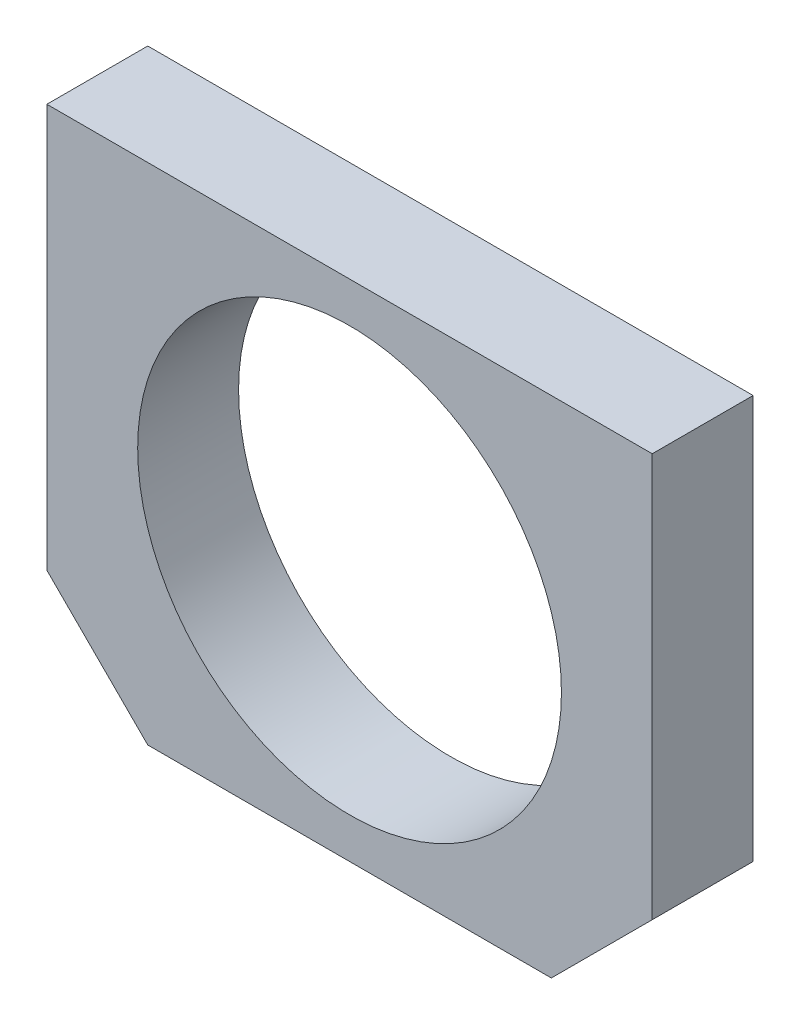
ISO-10303-21;
HEADER;
FILE_DESCRIPTION(('STEP AP214'),'2;1');
FILE_NAME('part.step','',(''),(''),'','','');
FILE_SCHEMA(('AUTOMOTIVE_DESIGN { 1 0 10303 214 1 1 1 1 }'));
ENDSEC;
DATA;
#1=APPLICATION_CONTEXT('core data for automotive mechanical design processes');
#2=APPLICATION_PROTOCOL_DEFINITION('international standard','automotive_design',2000,#1);
#3=PRODUCT_CONTEXT('',#1,'mechanical');
#4=PRODUCT('Part','Part','',(#3));
#5=PRODUCT_RELATED_PRODUCT_CATEGORY('part','',(#4));
#6=PRODUCT_DEFINITION_FORMATION('','',#4);
#7=PRODUCT_DEFINITION_CONTEXT('part definition',#1,'design');
#8=PRODUCT_DEFINITION('design','',#6,#7);
#9=PRODUCT_DEFINITION_SHAPE('','',#8);
#10=(LENGTH_UNIT() NAMED_UNIT(*) SI_UNIT(.MILLI.,.METRE.));
#11=(NAMED_UNIT(*) PLANE_ANGLE_UNIT() SI_UNIT($,.RADIAN.));
#12=(NAMED_UNIT(*) SI_UNIT($,.STERADIAN.) SOLID_ANGLE_UNIT());
#13=UNCERTAINTY_MEASURE_WITH_UNIT(LENGTH_MEASURE(1.E-05),#10,'distance_accuracy_value','');
#14=(GEOMETRIC_REPRESENTATION_CONTEXT(3) GLOBAL_UNCERTAINTY_ASSIGNED_CONTEXT((#13)) GLOBAL_UNIT_ASSIGNED_CONTEXT((#10,
#11,#12)) REPRESENTATION_CONTEXT('',''));
#15=CARTESIAN_POINT('',(0.,0.,0.));
#16=DIRECTION('',(0.,0.,1.));
#17=DIRECTION('',(1.,0.,0.));
#18=AXIS2_PLACEMENT_3D('',#15,#16,#17);
#19=CARTESIAN_POINT('',(0.,0.,10.));
#20=DIRECTION('',(0.,0.,1.));
#21=DIRECTION('',(1.,0.,0.));
#22=AXIS2_PLACEMENT_3D('',#19,#20,#21);
#23=PLANE('',#22);
#24=DIRECTION('',(-1.,0.,0.));
#25=VECTOR('',#24,1.);
#26=CARTESIAN_POINT('',(30.,25.,10.));
#27=LINE('',#26,#25);
#28=CARTESIAN_POINT('',(30.,25.,10.));
#29=VERTEX_POINT('',#28);
#30=CARTESIAN_POINT('',(-30.,25.,10.));
#31=VERTEX_POINT('',#30);
#32=EDGE_CURVE('E128',#29,#31,#27,.T.);
#33=ORIENTED_EDGE('',*,*,#32,.T.);
#34=DIRECTION('',(0.,-1.,0.));
#35=VECTOR('',#34,1.);
#36=CARTESIAN_POINT('',(-30.,25.,10.));
#37=LINE('',#36,#35);
#38=CARTESIAN_POINT('',(-30.,-15.,10.));
#39=VERTEX_POINT('',#38);
#40=EDGE_CURVE('E86',#31,#39,#37,.T.);
#41=ORIENTED_EDGE('',*,*,#40,.T.);
#42=DIRECTION('',(0.707106781186549,-0.707106781186546,0.));
#43=VECTOR('',#42,1.);
#44=CARTESIAN_POINT('',(-30.,-15.,10.));
#45=LINE('',#44,#43);
#46=CARTESIAN_POINT('',(-20.,-25.,10.));
#47=VERTEX_POINT('',#46);
#48=EDGE_CURVE('E99',#39,#47,#45,.T.);
#49=ORIENTED_EDGE('',*,*,#48,.T.);
#50=DIRECTION('',(1.,0.,0.));
#51=VECTOR('',#50,1.);
#52=CARTESIAN_POINT('',(-20.,-25.,10.));
#53=LINE('',#52,#51);
#54=CARTESIAN_POINT('',(20.,-25.,10.));
#55=VERTEX_POINT('',#54);
#56=EDGE_CURVE('E93',#47,#55,#53,.T.);
#57=ORIENTED_EDGE('',*,*,#56,.T.);
#58=DIRECTION('',(0.707106781186549,0.707106781186546,0.));
#59=VECTOR('',#58,1.);
#60=CARTESIAN_POINT('',(20.,-25.,10.));
#61=LINE('',#60,#59);
#62=CARTESIAN_POINT('',(30.,-15.,10.));
#63=VERTEX_POINT('',#62);
#64=EDGE_CURVE('E97',#55,#63,#61,.T.);
#65=ORIENTED_EDGE('',*,*,#64,.T.);
#66=DIRECTION('',(0.,1.,0.));
#67=VECTOR('',#66,1.);
#68=CARTESIAN_POINT('',(30.,-15.,10.));
#69=LINE('',#68,#67);
#70=EDGE_CURVE('E49',#63,#29,#69,.T.);
#71=ORIENTED_EDGE('',*,*,#70,.T.);
#72=EDGE_LOOP('',(#33,#41,#49,#57,#65,#71));
#73=FACE_BOUND('',#72,.T.);
#74=CARTESIAN_POINT('',(0.,0.,10.));
#75=DIRECTION('',(0.,0.,1.));
#76=DIRECTION('',(1.,0.,0.));
#77=AXIS2_PLACEMENT_3D('',#74,#75,#76);
#78=CIRCLE('',#77,21.);
#79=CARTESIAN_POINT('',(21.,0.,10.));
#80=VERTEX_POINT('',#79);
#81=EDGE_CURVE('E121',#80,#80,#78,.T.);
#82=ORIENTED_EDGE('',*,*,#81,.F.);
#83=EDGE_LOOP('',(#82));
#84=FACE_BOUND('',#83,.T.);
#85=ADVANCED_FACE('F32',(#73,#84),#23,.T.);
#86=CARTESIAN_POINT('',(0.,0.,0.));
#87=DIRECTION('',(0.,0.,1.));
#88=DIRECTION('',(1.,0.,0.));
#89=AXIS2_PLACEMENT_3D('',#86,#87,#88);
#90=PLANE('',#89);
#91=DIRECTION('',(-1.,0.,0.));
#92=VECTOR('',#91,1.);
#93=CARTESIAN_POINT('',(30.,25.,0.));
#94=LINE('',#93,#92);
#95=CARTESIAN_POINT('',(30.,25.,0.));
#96=VERTEX_POINT('',#95);
#97=CARTESIAN_POINT('',(-30.,25.,0.));
#98=VERTEX_POINT('',#97);
#99=EDGE_CURVE('E117',#96,#98,#94,.T.);
#100=ORIENTED_EDGE('',*,*,#99,.F.);
#101=DIRECTION('',(0.,1.,0.));
#102=VECTOR('',#101,1.);
#103=CARTESIAN_POINT('',(30.,-15.,0.));
#104=LINE('',#103,#102);
#105=CARTESIAN_POINT('',(30.,-15.,0.));
#106=VERTEX_POINT('',#105);
#107=EDGE_CURVE('E78',#106,#96,#104,.T.);
#108=ORIENTED_EDGE('',*,*,#107,.F.);
#109=DIRECTION('',(0.707106781186549,0.707106781186546,0.));
#110=VECTOR('',#109,1.);
#111=CARTESIAN_POINT('',(20.,-25.,0.));
#112=LINE('',#111,#110);
#113=CARTESIAN_POINT('',(20.,-25.,0.));
#114=VERTEX_POINT('',#113);
#115=EDGE_CURVE('E72',#114,#106,#112,.T.);
#116=ORIENTED_EDGE('',*,*,#115,.F.);
#117=DIRECTION('',(1.,0.,0.));
#118=VECTOR('',#117,1.);
#119=CARTESIAN_POINT('',(-20.,-25.,0.));
#120=LINE('',#119,#118);
#121=CARTESIAN_POINT('',(-20.,-25.,0.));
#122=VERTEX_POINT('',#121);
#123=EDGE_CURVE('E107',#122,#114,#120,.T.);
#124=ORIENTED_EDGE('',*,*,#123,.F.);
#125=DIRECTION('',(0.707106781186549,-0.707106781186546,0.));
#126=VECTOR('',#125,1.);
#127=CARTESIAN_POINT('',(-30.,-15.,0.));
#128=LINE('',#127,#126);
#129=CARTESIAN_POINT('',(-30.,-15.,0.));
#130=VERTEX_POINT('',#129);
#131=EDGE_CURVE('E123',#130,#122,#128,.T.);
#132=ORIENTED_EDGE('',*,*,#131,.F.);
#133=DIRECTION('',(0.,-1.,0.));
#134=VECTOR('',#133,1.);
#135=CARTESIAN_POINT('',(-30.,25.,0.));
#136=LINE('',#135,#134);
#137=EDGE_CURVE('E120',#98,#130,#136,.T.);
#138=ORIENTED_EDGE('',*,*,#137,.F.);
#139=EDGE_LOOP('',(#100,#108,#116,#124,#132,#138));
#140=FACE_BOUND('',#139,.T.);
#141=CARTESIAN_POINT('',(0.,0.,0.));
#142=DIRECTION('',(0.,0.,1.));
#143=DIRECTION('',(1.,0.,0.));
#144=AXIS2_PLACEMENT_3D('',#141,#142,#143);
#145=CIRCLE('',#144,21.);
#146=CARTESIAN_POINT('',(21.,0.,0.));
#147=VERTEX_POINT('',#146);
#148=EDGE_CURVE('E221',#147,#147,#145,.T.);
#149=ORIENTED_EDGE('',*,*,#148,.T.);
#150=EDGE_LOOP('',(#149));
#151=FACE_BOUND('',#150,.T.);
#152=ADVANCED_FACE('F137',(#140,#151),#90,.F.);
#153=CARTESIAN_POINT('',(30.,25.,10.));
#154=DIRECTION('',(0.,-1.,0.));
#155=DIRECTION('',(1.,0.,0.));
#156=AXIS2_PLACEMENT_3D('',#153,#154,#155);
#157=PLANE('',#156);
#158=ORIENTED_EDGE('',*,*,#99,.T.);
#159=DIRECTION('',(0.,0.,-1.));
#160=VECTOR('',#159,1.);
#161=CARTESIAN_POINT('',(-30.,25.,10.));
#162=LINE('',#161,#160);
#163=EDGE_CURVE('E11',#31,#98,#162,.T.);
#164=ORIENTED_EDGE('',*,*,#163,.F.);
#165=ORIENTED_EDGE('',*,*,#32,.F.);
#166=DIRECTION('',(0.,0.,-1.));
#167=VECTOR('',#166,1.);
#168=CARTESIAN_POINT('',(30.,25.,10.));
#169=LINE('',#168,#167);
#170=EDGE_CURVE('E113',#29,#96,#169,.T.);
#171=ORIENTED_EDGE('',*,*,#170,.T.);
#172=EDGE_LOOP('',(#158,#164,#165,#171));
#173=FACE_BOUND('',#172,.T.);
#174=ADVANCED_FACE('F34',(#173),#157,.F.);
#175=CARTESIAN_POINT('',(-30.,25.,10.));
#176=DIRECTION('',(1.,0.,0.));
#177=DIRECTION('',(0.,1.,0.));
#178=AXIS2_PLACEMENT_3D('',#175,#176,#177);
#179=PLANE('',#178);
#180=ORIENTED_EDGE('',*,*,#137,.T.);
#181=DIRECTION('',(0.,0.,-1.));
#182=VECTOR('',#181,1.);
#183=CARTESIAN_POINT('',(-30.,-15.,10.));
#184=LINE('',#183,#182);
#185=EDGE_CURVE('E41',#39,#130,#184,.T.);
#186=ORIENTED_EDGE('',*,*,#185,.F.);
#187=ORIENTED_EDGE('',*,*,#40,.F.);
#188=ORIENTED_EDGE('',*,*,#163,.T.);
#189=EDGE_LOOP('',(#180,#186,#187,#188));
#190=FACE_BOUND('',#189,.T.);
#191=ADVANCED_FACE('F162',(#190),#179,.F.);
#192=CARTESIAN_POINT('',(-30.,-15.,10.));
#193=DIRECTION('',(0.707106781186546,0.707106781186549,0.));
#194=DIRECTION('',(-0.707106781186549,0.707106781186546,0.));
#195=AXIS2_PLACEMENT_3D('',#192,#193,#194);
#196=PLANE('',#195);
#197=ORIENTED_EDGE('',*,*,#131,.T.);
#198=DIRECTION('',(0.,0.,-1.));
#199=VECTOR('',#198,1.);
#200=CARTESIAN_POINT('',(-20.,-25.,10.));
#201=LINE('',#200,#199);
#202=EDGE_CURVE('E108',#47,#122,#201,.T.);
#203=ORIENTED_EDGE('',*,*,#202,.F.);
#204=ORIENTED_EDGE('',*,*,#48,.F.);
#205=ORIENTED_EDGE('',*,*,#185,.T.);
#206=EDGE_LOOP('',(#197,#203,#204,#205));
#207=FACE_BOUND('',#206,.T.);
#208=ADVANCED_FACE('F134',(#207),#196,.F.);
#209=CARTESIAN_POINT('',(-20.,-25.,10.));
#210=DIRECTION('',(0.,1.,0.));
#211=DIRECTION('',(0.,0.,1.));
#212=AXIS2_PLACEMENT_3D('',#209,#210,#211);
#213=PLANE('',#212);
#214=ORIENTED_EDGE('',*,*,#123,.T.);
#215=DIRECTION('',(0.,0.,-1.));
#216=VECTOR('',#215,1.);
#217=CARTESIAN_POINT('',(20.,-25.,10.));
#218=LINE('',#217,#216);
#219=EDGE_CURVE('E104',#55,#114,#218,.T.);
#220=ORIENTED_EDGE('',*,*,#219,.F.);
#221=ORIENTED_EDGE('',*,*,#56,.F.);
#222=ORIENTED_EDGE('',*,*,#202,.T.);
#223=EDGE_LOOP('',(#214,#220,#221,#222));
#224=FACE_BOUND('',#223,.T.);
#225=ADVANCED_FACE('F105',(#224),#213,.F.);
#226=CARTESIAN_POINT('',(20.,-25.,10.));
#227=DIRECTION('',(-0.707106781186546,0.707106781186549,0.));
#228=DIRECTION('',(-0.707106781186549,-0.707106781186546,0.));
#229=AXIS2_PLACEMENT_3D('',#226,#227,#228);
#230=PLANE('',#229);
#231=ORIENTED_EDGE('',*,*,#115,.T.);
#232=DIRECTION('',(0.,0.,-1.));
#233=VECTOR('',#232,1.);
#234=CARTESIAN_POINT('',(30.,-15.,10.));
#235=LINE('',#234,#233);
#236=EDGE_CURVE('E109',#63,#106,#235,.T.);
#237=ORIENTED_EDGE('',*,*,#236,.F.);
#238=ORIENTED_EDGE('',*,*,#64,.F.);
#239=ORIENTED_EDGE('',*,*,#219,.T.);
#240=EDGE_LOOP('',(#231,#237,#238,#239));
#241=FACE_BOUND('',#240,.T.);
#242=ADVANCED_FACE('F111',(#241),#230,.F.);
#243=CARTESIAN_POINT('',(30.,-15.,10.));
#244=DIRECTION('',(-1.,0.,0.));
#245=DIRECTION('',(0.,0.,1.));
#246=AXIS2_PLACEMENT_3D('',#243,#244,#245);
#247=PLANE('',#246);
#248=ORIENTED_EDGE('',*,*,#107,.T.);
#249=ORIENTED_EDGE('',*,*,#170,.F.);
#250=ORIENTED_EDGE('',*,*,#70,.F.);
#251=ORIENTED_EDGE('',*,*,#236,.T.);
#252=EDGE_LOOP('',(#248,#249,#250,#251));
#253=FACE_BOUND('',#252,.T.);
#254=ADVANCED_FACE('F142',(#253),#247,.F.);
#255=CARTESIAN_POINT('',(0.,0.,10.));
#256=DIRECTION('',(0.,0.,-1.));
#257=DIRECTION('',(-1.,0.,0.));
#258=AXIS2_PLACEMENT_3D('',#255,#256,#257);
#259=CYLINDRICAL_SURFACE('',#258,21.);
#260=ORIENTED_EDGE('',*,*,#81,.T.);
#261=EDGE_LOOP('',(#260));
#262=FACE_BOUND('',#261,.T.);
#263=ORIENTED_EDGE('',*,*,#148,.F.);
#264=EDGE_LOOP('',(#263));
#265=FACE_BOUND('',#264,.T.);
#266=ADVANCED_FACE('F144',(#262,#265),#259,.F.);
#267=CLOSED_SHELL('',(#85,#152,#174,#191,#208,#225,#242,#254,#266));
#268=MANIFOLD_SOLID_BREP('B2',#267);
#269=ADVANCED_BREP_SHAPE_REPRESENTATION('',(#18,#268),#14);
#270=SHAPE_DEFINITION_REPRESENTATION(#9,#269);
ENDSEC;
END-ISO-10303-21;
